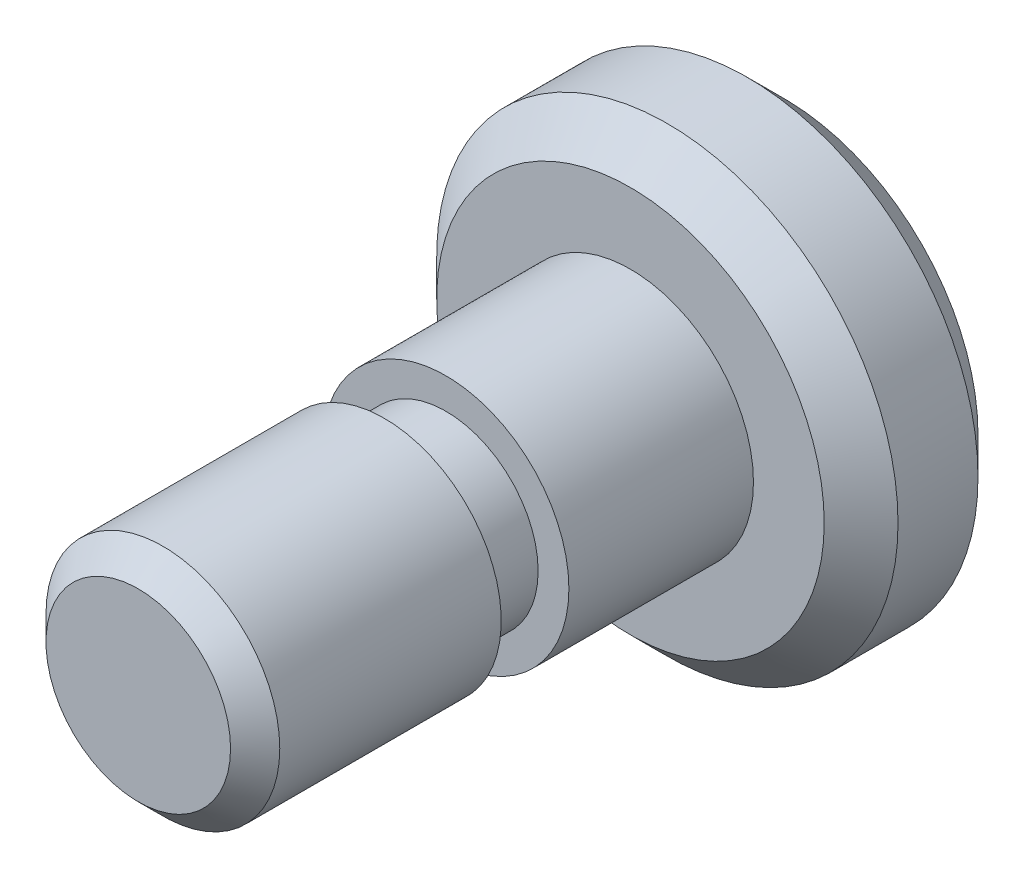
ISO-10303-21;
HEADER;
FILE_DESCRIPTION(('STEP AP214'),'2;1');
FILE_NAME('part.step','',(''),(''),'','','');
FILE_SCHEMA(('AUTOMOTIVE_DESIGN { 1 0 10303 214 1 1 1 1 }'));
ENDSEC;
DATA;
#1=APPLICATION_CONTEXT('core data for automotive mechanical design processes');
#2=APPLICATION_PROTOCOL_DEFINITION('international standard','automotive_design',2000,#1);
#3=PRODUCT_CONTEXT('',#1,'mechanical');
#4=PRODUCT('Part','Part','',(#3));
#5=PRODUCT_RELATED_PRODUCT_CATEGORY('part','',(#4));
#6=PRODUCT_DEFINITION_FORMATION('','',#4);
#7=PRODUCT_DEFINITION_CONTEXT('part definition',#1,'design');
#8=PRODUCT_DEFINITION('design','',#6,#7);
#9=PRODUCT_DEFINITION_SHAPE('','',#8);
#10=(LENGTH_UNIT() NAMED_UNIT(*) SI_UNIT(.MILLI.,.METRE.));
#11=(NAMED_UNIT(*) PLANE_ANGLE_UNIT() SI_UNIT($,.RADIAN.));
#12=(NAMED_UNIT(*) SI_UNIT($,.STERADIAN.) SOLID_ANGLE_UNIT());
#13=UNCERTAINTY_MEASURE_WITH_UNIT(LENGTH_MEASURE(1.E-05),#10,'distance_accuracy_value','');
#14=(GEOMETRIC_REPRESENTATION_CONTEXT(3) GLOBAL_UNCERTAINTY_ASSIGNED_CONTEXT((#13)) GLOBAL_UNIT_ASSIGNED_CONTEXT((#10,
#11,#12)) REPRESENTATION_CONTEXT('',''));
#15=CARTESIAN_POINT('',(0.,0.,0.));
#16=DIRECTION('',(0.,0.,1.));
#17=DIRECTION('',(1.,0.,0.));
#18=AXIS2_PLACEMENT_3D('',#15,#16,#17);
#19=CARTESIAN_POINT('',(0.,0.,3.17500000000003));
#20=DIRECTION('',(0.,0.,-1.));
#21=DIRECTION('',(-0.999999999999995,0.,0.));
#22=AXIS2_PLACEMENT_3D('',#19,#20,#21);
#23=CYLINDRICAL_SURFACE('',#22,4.7625);
#24=CARTESIAN_POINT('',(0.,0.,2.41300000000003));
#25=DIRECTION('',(0.,0.,1.));
#26=DIRECTION('',(0.999999999999995,0.,0.));
#27=AXIS2_PLACEMENT_3D('',#24,#25,#26);
#28=CIRCLE('',#27,4.7625);
#29=CARTESIAN_POINT('',(4.76249999999998,0.,2.41300000000003));
#30=VERTEX_POINT('',#29);
#31=EDGE_CURVE('E56',#30,#30,#28,.F.);
#32=ORIENTED_EDGE('',*,*,#31,.T.);
#33=EDGE_LOOP('',(#32));
#34=FACE_BOUND('',#33,.T.);
#35=CARTESIAN_POINT('',(0.,0.,0.762000000000027));
#36=DIRECTION('',(0.,0.,1.));
#37=DIRECTION('',(0.999999999999995,0.,0.));
#38=AXIS2_PLACEMENT_3D('',#35,#36,#37);
#39=CIRCLE('',#38,4.7625);
#40=CARTESIAN_POINT('',(4.76249999999998,0.,0.762000000000027));
#41=VERTEX_POINT('',#40);
#42=EDGE_CURVE('E60',#41,#41,#39,.T.);
#43=ORIENTED_EDGE('',*,*,#42,.T.);
#44=EDGE_LOOP('',(#43));
#45=FACE_BOUND('',#44,.T.);
#46=ADVANCED_FACE('F49',(#34,#45),#23,.T.);
#47=CARTESIAN_POINT('',(0.,0.,3.17500000000003));
#48=DIRECTION('',(0.,0.,1.));
#49=DIRECTION('',(0.999999999999995,0.,0.));
#50=AXIS2_PLACEMENT_3D('',#47,#48,#49);
#51=PLANE('',#50);
#52=CARTESIAN_POINT('',(0.,0.,3.17500000000003));
#53=DIRECTION('',(0.,0.,1.));
#54=DIRECTION('',(0.999999999999995,0.,0.));
#55=AXIS2_PLACEMENT_3D('',#52,#53,#54);
#56=CIRCLE('',#55,4.0005);
#57=CARTESIAN_POINT('',(4.00049999999998,0.,3.17500000000003));
#58=VERTEX_POINT('',#57);
#59=EDGE_CURVE('E64',#58,#58,#56,.T.);
#60=ORIENTED_EDGE('',*,*,#59,.T.);
#61=EDGE_LOOP('',(#60));
#62=FACE_BOUND('',#61,.T.);
#63=CARTESIAN_POINT('',(0.,0.,3.17500000000003));
#64=DIRECTION('',(0.,0.,1.));
#65=DIRECTION('',(0.999999999999995,0.,0.));
#66=AXIS2_PLACEMENT_3D('',#63,#64,#65);
#67=CIRCLE('',#66,2.54);
#68=CARTESIAN_POINT('',(2.53999999999999,0.,3.17500000000003));
#69=VERTEX_POINT('',#68);
#70=EDGE_CURVE('E80',#69,#69,#67,.T.);
#71=ORIENTED_EDGE('',*,*,#70,.F.);
#72=EDGE_LOOP('',(#71));
#73=FACE_BOUND('',#72,.T.);
#74=ADVANCED_FACE('F111',(#62,#73),#51,.T.);
#75=CARTESIAN_POINT('',(0.,0.,0.));
#76=DIRECTION('',(0.,0.,1.));
#77=DIRECTION('',(0.999999999999995,0.,0.));
#78=AXIS2_PLACEMENT_3D('',#75,#76,#77);
#79=PLANE('',#78);
#80=CARTESIAN_POINT('',(0.,0.,0.));
#81=DIRECTION('',(0.,0.,1.));
#82=DIRECTION('',(0.999999999999995,0.,0.));
#83=AXIS2_PLACEMENT_3D('',#80,#81,#82);
#84=CIRCLE('',#83,4.00049999999999);
#85=CARTESIAN_POINT('',(4.00049999999997,0.,0.));
#86=VERTEX_POINT('',#85);
#87=EDGE_CURVE('E12',#86,#86,#84,.F.);
#88=ORIENTED_EDGE('',*,*,#87,.T.);
#89=EDGE_LOOP('',(#88));
#90=FACE_BOUND('',#89,.T.);
#91=ADVANCED_FACE('F106',(#90),#79,.F.);
#92=CARTESIAN_POINT('',(0.,0.,6.98500000000005));
#93=DIRECTION('',(0.,0.,-1.));
#94=DIRECTION('',(-0.999999999999995,0.,0.));
#95=AXIS2_PLACEMENT_3D('',#92,#93,#94);
#96=CYLINDRICAL_SURFACE('',#95,2.54);
#97=CARTESIAN_POINT('',(0.,0.,6.98500000000005));
#98=DIRECTION('',(0.,0.,1.));
#99=DIRECTION('',(0.999999999999995,0.,0.));
#100=AXIS2_PLACEMENT_3D('',#97,#98,#99);
#101=CIRCLE('',#100,2.54);
#102=CARTESIAN_POINT('',(2.53999999999999,0.,6.98500000000005));
#103=VERTEX_POINT('',#102);
#104=EDGE_CURVE('E73',#103,#103,#101,.T.);
#105=ORIENTED_EDGE('',*,*,#104,.F.);
#106=EDGE_LOOP('',(#105));
#107=FACE_BOUND('',#106,.T.);
#108=ORIENTED_EDGE('',*,*,#70,.T.);
#109=EDGE_LOOP('',(#108));
#110=FACE_BOUND('',#109,.T.);
#111=ADVANCED_FACE('F97',(#107,#110),#96,.T.);
#112=CARTESIAN_POINT('',(0.,0.,6.98500000000005));
#113=DIRECTION('',(0.,0.,1.));
#114=DIRECTION('',(0.999999999999995,0.,0.));
#115=AXIS2_PLACEMENT_3D('',#112,#113,#114);
#116=PLANE('',#115);
#117=ORIENTED_EDGE('',*,*,#104,.T.);
#118=EDGE_LOOP('',(#117));
#119=FACE_BOUND('',#118,.T.);
#120=CARTESIAN_POINT('',(0.,0.,6.98500000000005));
#121=DIRECTION('',(0.,0.,1.));
#122=DIRECTION('',(0.999999999999995,0.,0.));
#123=AXIS2_PLACEMENT_3D('',#120,#121,#122);
#124=CIRCLE('',#123,1.905);
#125=CARTESIAN_POINT('',(1.90499999999999,0.,6.98500000000005));
#126=VERTEX_POINT('',#125);
#127=EDGE_CURVE('E87',#126,#126,#124,.T.);
#128=ORIENTED_EDGE('',*,*,#127,.F.);
#129=EDGE_LOOP('',(#128));
#130=FACE_BOUND('',#129,.T.);
#131=ADVANCED_FACE('F94',(#119,#130),#116,.T.);
#132=CARTESIAN_POINT('',(-2.54000000000004,0.,8.255));
#133=DIRECTION('',(0.,0.,-1.));
#134=DIRECTION('',(-0.999999999999995,0.,0.));
#135=AXIS2_PLACEMENT_3D('',#132,#133,#134);
#136=PLANE('',#135);
#137=CARTESIAN_POINT('',(0.,0.,8.25500000000003));
#138=DIRECTION('',(0.,0.,1.));
#139=DIRECTION('',(0.999999999999995,0.,0.));
#140=AXIS2_PLACEMENT_3D('',#137,#138,#139);
#141=CIRCLE('',#140,1.905);
#142=CARTESIAN_POINT('',(1.90499999999999,0.,8.25500000000003));
#143=VERTEX_POINT('',#142);
#144=EDGE_CURVE('E74',#143,#143,#141,.T.);
#145=ORIENTED_EDGE('',*,*,#144,.T.);
#146=EDGE_LOOP('',(#145));
#147=FACE_BOUND('',#146,.T.);
#148=CARTESIAN_POINT('',(0.,0.,8.25500000000003));
#149=DIRECTION('',(0.,0.,-1.));
#150=DIRECTION('',(-0.999999999999995,0.,0.));
#151=AXIS2_PLACEMENT_3D('',#148,#149,#150);
#152=CIRCLE('',#151,2.413);
#153=CARTESIAN_POINT('',(-2.41299999999999,0.,8.25500000000003));
#154=VERTEX_POINT('',#153);
#155=EDGE_CURVE('E70',#154,#154,#152,.T.);
#156=ORIENTED_EDGE('',*,*,#155,.T.);
#157=EDGE_LOOP('',(#156));
#158=FACE_BOUND('',#157,.T.);
#159=ADVANCED_FACE('F96',(#147,#158),#136,.T.);
#160=CARTESIAN_POINT('',(0.,0.,23.0537819710151));
#161=DIRECTION('',(0.,0.,1.));
#162=DIRECTION('',(0.999999999999995,0.,0.));
#163=AXIS2_PLACEMENT_3D('',#160,#161,#162);
#164=CYLINDRICAL_SURFACE('',#163,1.905);
#165=ORIENTED_EDGE('',*,*,#127,.T.);
#166=EDGE_LOOP('',(#165));
#167=FACE_BOUND('',#166,.T.);
#168=ORIENTED_EDGE('',*,*,#144,.F.);
#169=EDGE_LOOP('',(#168));
#170=FACE_BOUND('',#169,.T.);
#171=ADVANCED_FACE('F91',(#167,#170),#164,.T.);
#172=CARTESIAN_POINT('',(0.,0.,13.335));
#173=DIRECTION('',(0.,0.,1.));
#174=DIRECTION('',(0.999999999999995,0.,0.));
#175=AXIS2_PLACEMENT_3D('',#172,#173,#174);
#176=PLANE('',#175);
#177=CARTESIAN_POINT('',(0.,0.,13.335));
#178=DIRECTION('',(0.,0.,1.));
#179=DIRECTION('',(0.999999999999995,0.,0.));
#180=AXIS2_PLACEMENT_3D('',#177,#178,#179);
#181=CIRCLE('',#180,1.905);
#182=CARTESIAN_POINT('',(1.90499999999999,0.,13.335));
#183=VERTEX_POINT('',#182);
#184=EDGE_CURVE('E77',#183,#183,#181,.T.);
#185=ORIENTED_EDGE('',*,*,#184,.T.);
#186=EDGE_LOOP('',(#185));
#187=FACE_BOUND('',#186,.T.);
#188=ADVANCED_FACE('F124',(#187),#176,.T.);
#189=CARTESIAN_POINT('',(0.,0.,13.335));
#190=DIRECTION('',(0.,0.,-1.));
#191=DIRECTION('',(-0.999999999999995,0.,0.));
#192=AXIS2_PLACEMENT_3D('',#189,#190,#191);
#193=CONICAL_SURFACE('',#192,1.905,0.785398163397446);
#194=CARTESIAN_POINT('',(0.,0.,12.827));
#195=DIRECTION('',(0.,0.,1.));
#196=DIRECTION('',(0.999999999999995,0.,0.));
#197=AXIS2_PLACEMENT_3D('',#194,#195,#196);
#198=CIRCLE('',#197,2.413);
#199=CARTESIAN_POINT('',(2.41299999999999,0.,12.827));
#200=VERTEX_POINT('',#199);
#201=EDGE_CURVE('E69',#200,#200,#198,.F.);
#202=ORIENTED_EDGE('',*,*,#201,.F.);
#203=EDGE_LOOP('',(#202));
#204=FACE_BOUND('',#203,.T.);
#205=ORIENTED_EDGE('',*,*,#184,.F.);
#206=EDGE_LOOP('',(#205));
#207=FACE_BOUND('',#206,.T.);
#208=ADVANCED_FACE('F121',(#204,#207),#193,.T.);
#209=CARTESIAN_POINT('',(0.,0.,13.335));
#210=DIRECTION('',(0.,0.,-1.));
#211=DIRECTION('',(-0.999999999999995,0.,0.));
#212=AXIS2_PLACEMENT_3D('',#209,#210,#211);
#213=CYLINDRICAL_SURFACE('',#212,2.413);
#214=ORIENTED_EDGE('',*,*,#201,.T.);
#215=EDGE_LOOP('',(#214));
#216=FACE_BOUND('',#215,.T.);
#217=ORIENTED_EDGE('',*,*,#155,.F.);
#218=EDGE_LOOP('',(#217));
#219=FACE_BOUND('',#218,.T.);
#220=ADVANCED_FACE('F123',(#216,#219),#213,.T.);
#221=CARTESIAN_POINT('',(0.,0.,3.17500000000003));
#222=DIRECTION('',(0.,0.,-1.));
#223=DIRECTION('',(-0.999999999999995,0.,0.));
#224=AXIS2_PLACEMENT_3D('',#221,#222,#223);
#225=CONICAL_SURFACE('',#224,4.0005,0.785398163397447);
#226=ORIENTED_EDGE('',*,*,#31,.F.);
#227=EDGE_LOOP('',(#226));
#228=FACE_BOUND('',#227,.T.);
#229=ORIENTED_EDGE('',*,*,#59,.F.);
#230=EDGE_LOOP('',(#229));
#231=FACE_BOUND('',#230,.T.);
#232=ADVANCED_FACE('F126',(#228,#231),#225,.T.);
#233=CARTESIAN_POINT('',(0.,0.,0.762000000000027));
#234=DIRECTION('',(0.,0.,1.));
#235=DIRECTION('',(0.999999999999995,0.,0.));
#236=AXIS2_PLACEMENT_3D('',#233,#234,#235);
#237=CONICAL_SURFACE('',#236,4.7625,0.785398163397451);
#238=ORIENTED_EDGE('',*,*,#87,.F.);
#239=EDGE_LOOP('',(#238));
#240=FACE_BOUND('',#239,.T.);
#241=ORIENTED_EDGE('',*,*,#42,.F.);
#242=EDGE_LOOP('',(#241));
#243=FACE_BOUND('',#242,.T.);
#244=ADVANCED_FACE('F51',(#240,#243),#237,.T.);
#245=CLOSED_SHELL('',(#46,#74,#91,#111,#131,#159,#171,#188,#208,#220,#232,#244));
#246=MANIFOLD_SOLID_BREP('B2',#245);
#247=ADVANCED_BREP_SHAPE_REPRESENTATION('',(#18,#246),#14);
#248=SHAPE_DEFINITION_REPRESENTATION(#9,#247);
ENDSEC;
END-ISO-10303-21;
